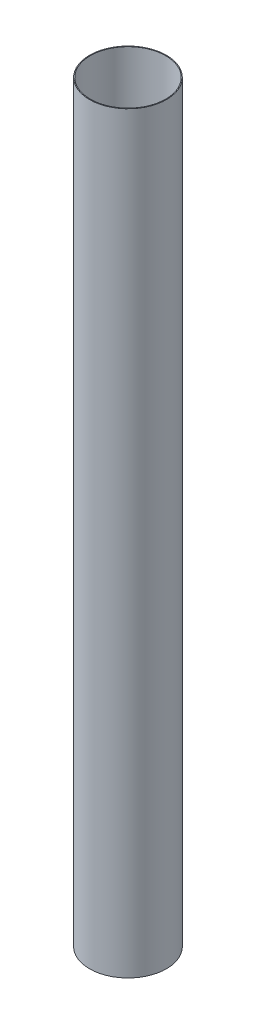
ISO-10303-21;
HEADER;
FILE_DESCRIPTION(('STEP AP214'),'2;1');
FILE_NAME('part.step','',(''),(''),'','','');
FILE_SCHEMA(('AUTOMOTIVE_DESIGN { 1 0 10303 214 1 1 1 1 }'));
ENDSEC;
DATA;
#1=APPLICATION_CONTEXT('core data for automotive mechanical design processes');
#2=APPLICATION_PROTOCOL_DEFINITION('international standard','automotive_design',2000,#1);
#3=PRODUCT_CONTEXT('',#1,'mechanical');
#4=PRODUCT('Part','Part','',(#3));
#5=PRODUCT_RELATED_PRODUCT_CATEGORY('part','',(#4));
#6=PRODUCT_DEFINITION_FORMATION('','',#4);
#7=PRODUCT_DEFINITION_CONTEXT('part definition',#1,'design');
#8=PRODUCT_DEFINITION('design','',#6,#7);
#9=PRODUCT_DEFINITION_SHAPE('','',#8);
#10=(LENGTH_UNIT() NAMED_UNIT(*) SI_UNIT(.MILLI.,.METRE.));
#11=(NAMED_UNIT(*) PLANE_ANGLE_UNIT() SI_UNIT($,.RADIAN.));
#12=(NAMED_UNIT(*) SI_UNIT($,.STERADIAN.) SOLID_ANGLE_UNIT());
#13=UNCERTAINTY_MEASURE_WITH_UNIT(LENGTH_MEASURE(1.E-05),#10,'distance_accuracy_value','');
#14=(GEOMETRIC_REPRESENTATION_CONTEXT(3) GLOBAL_UNCERTAINTY_ASSIGNED_CONTEXT((#13)) GLOBAL_UNIT_ASSIGNED_CONTEXT((#10,
#11,#12)) REPRESENTATION_CONTEXT('',''));
#15=CARTESIAN_POINT('',(0.,0.,0.));
#16=DIRECTION('',(0.,0.,1.));
#17=DIRECTION('',(1.,0.,0.));
#18=AXIS2_PLACEMENT_3D('',#15,#16,#17);
#19=CARTESIAN_POINT('',(0.,1524.,0.));
#20=DIRECTION('',(0.,1.,0.));
#21=DIRECTION('',(0.,0.,1.));
#22=AXIS2_PLACEMENT_3D('',#19,#20,#21);
#23=PLANE('',#22);
#24=CARTESIAN_POINT('',(0.,1524.,0.));
#25=DIRECTION('',(0.,1.,0.));
#26=DIRECTION('',(0.,0.,1.));
#27=AXIS2_PLACEMENT_3D('',#24,#25,#26);
#28=CIRCLE('',#27,77.8637);
#29=CARTESIAN_POINT('',(0.,1524.,77.8637));
#30=VERTEX_POINT('',#29);
#31=EDGE_CURVE('E10',#30,#30,#28,.T.);
#32=ORIENTED_EDGE('',*,*,#31,.T.);
#33=EDGE_LOOP('',(#32));
#34=FACE_BOUND('',#33,.T.);
#35=CARTESIAN_POINT('',(0.,1524.,0.));
#36=DIRECTION('',(0.,1.,0.));
#37=DIRECTION('',(0.,0.,1.));
#38=AXIS2_PLACEMENT_3D('',#35,#36,#37);
#39=CIRCLE('',#38,76.2889);
#40=CARTESIAN_POINT('',(0.,1524.,76.2889));
#41=VERTEX_POINT('',#40);
#42=EDGE_CURVE('E42',#41,#41,#39,.T.);
#43=ORIENTED_EDGE('',*,*,#42,.F.);
#44=EDGE_LOOP('',(#43));
#45=FACE_BOUND('',#44,.T.);
#46=ADVANCED_FACE('F31',(#34,#45),#23,.T.);
#47=CARTESIAN_POINT('',(0.,0.,0.));
#48=DIRECTION('',(0.,1.,0.));
#49=DIRECTION('',(0.,0.,1.));
#50=AXIS2_PLACEMENT_3D('',#47,#48,#49);
#51=PLANE('',#50);
#52=CARTESIAN_POINT('',(0.,0.,0.));
#53=DIRECTION('',(0.,1.,0.));
#54=DIRECTION('',(0.,0.,1.));
#55=AXIS2_PLACEMENT_3D('',#52,#53,#54);
#56=CIRCLE('',#55,77.8637);
#57=CARTESIAN_POINT('',(0.,0.,77.8637));
#58=VERTEX_POINT('',#57);
#59=EDGE_CURVE('E35',#58,#58,#56,.T.);
#60=ORIENTED_EDGE('',*,*,#59,.F.);
#61=EDGE_LOOP('',(#60));
#62=FACE_BOUND('',#61,.T.);
#63=CARTESIAN_POINT('',(0.,0.,0.));
#64=DIRECTION('',(0.,1.,0.));
#65=DIRECTION('',(0.,0.,1.));
#66=AXIS2_PLACEMENT_3D('',#63,#64,#65);
#67=CIRCLE('',#66,76.2889);
#68=CARTESIAN_POINT('',(0.,0.,76.2889));
#69=VERTEX_POINT('',#68);
#70=EDGE_CURVE('E44',#69,#69,#67,.T.);
#71=ORIENTED_EDGE('',*,*,#70,.T.);
#72=EDGE_LOOP('',(#71));
#73=FACE_BOUND('',#72,.T.);
#74=ADVANCED_FACE('F54',(#62,#73),#51,.F.);
#75=CARTESIAN_POINT('',(0.,1524.,0.));
#76=DIRECTION('',(0.,-1.,0.));
#77=DIRECTION('',(0.,0.,-1.));
#78=AXIS2_PLACEMENT_3D('',#75,#76,#77);
#79=CYLINDRICAL_SURFACE('',#78,77.8637);
#80=ORIENTED_EDGE('',*,*,#31,.F.);
#81=EDGE_LOOP('',(#80));
#82=FACE_BOUND('',#81,.T.);
#83=ORIENTED_EDGE('',*,*,#59,.T.);
#84=EDGE_LOOP('',(#83));
#85=FACE_BOUND('',#84,.T.);
#86=ADVANCED_FACE('F33',(#82,#85),#79,.T.);
#87=CARTESIAN_POINT('',(0.,1524.,0.));
#88=DIRECTION('',(0.,-1.,0.));
#89=DIRECTION('',(0.,0.,-1.));
#90=AXIS2_PLACEMENT_3D('',#87,#88,#89);
#91=CYLINDRICAL_SURFACE('',#90,76.2889);
#92=ORIENTED_EDGE('',*,*,#42,.T.);
#93=EDGE_LOOP('',(#92));
#94=FACE_BOUND('',#93,.T.);
#95=ORIENTED_EDGE('',*,*,#70,.F.);
#96=EDGE_LOOP('',(#95));
#97=FACE_BOUND('',#96,.T.);
#98=ADVANCED_FACE('F50',(#94,#97),#91,.F.);
#99=CLOSED_SHELL('',(#46,#74,#86,#98));
#100=MANIFOLD_SOLID_BREP('B2',#99);
#101=ADVANCED_BREP_SHAPE_REPRESENTATION('',(#18,#100),#14);
#102=SHAPE_DEFINITION_REPRESENTATION(#9,#101);
ENDSEC;
END-ISO-10303-21;
